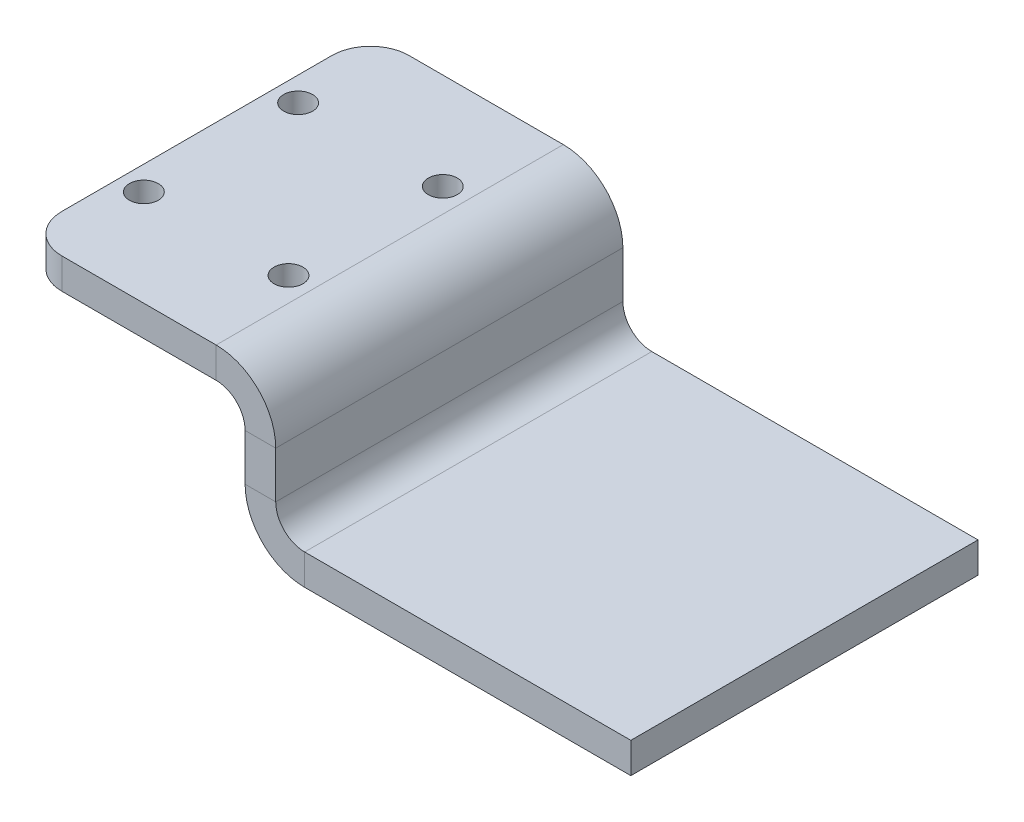
ISO-10303-21;
HEADER;
FILE_DESCRIPTION(('STEP AP214'),'2;1');
FILE_NAME('part.step','',(''),(''),'','','');
FILE_SCHEMA(('AUTOMOTIVE_DESIGN { 1 0 10303 214 1 1 1 1 }'));
ENDSEC;
DATA;
#1=APPLICATION_CONTEXT('core data for automotive mechanical design processes');
#2=APPLICATION_PROTOCOL_DEFINITION('international standard','automotive_design',2000,#1);
#3=PRODUCT_CONTEXT('',#1,'mechanical');
#4=PRODUCT('Part','Part','',(#3));
#5=PRODUCT_RELATED_PRODUCT_CATEGORY('part','',(#4));
#6=PRODUCT_DEFINITION_FORMATION('','',#4);
#7=PRODUCT_DEFINITION_CONTEXT('part definition',#1,'design');
#8=PRODUCT_DEFINITION('design','',#6,#7);
#9=PRODUCT_DEFINITION_SHAPE('','',#8);
#10=(LENGTH_UNIT() NAMED_UNIT(*) SI_UNIT(.MILLI.,.METRE.));
#11=(NAMED_UNIT(*) PLANE_ANGLE_UNIT() SI_UNIT($,.RADIAN.));
#12=(NAMED_UNIT(*) SI_UNIT($,.STERADIAN.) SOLID_ANGLE_UNIT());
#13=UNCERTAINTY_MEASURE_WITH_UNIT(LENGTH_MEASURE(1.E-05),#10,'distance_accuracy_value','');
#14=(GEOMETRIC_REPRESENTATION_CONTEXT(3) GLOBAL_UNCERTAINTY_ASSIGNED_CONTEXT((#13)) GLOBAL_UNIT_ASSIGNED_CONTEXT((#10,
#11,#12)) REPRESENTATION_CONTEXT('',''));
#15=CARTESIAN_POINT('',(0.,0.,0.));
#16=DIRECTION('',(0.,0.,1.));
#17=DIRECTION('',(1.,0.,0.));
#18=AXIS2_PLACEMENT_3D('',#15,#16,#17);
#19=CARTESIAN_POINT('',(26.175,-14.,18.));
#20=DIRECTION('',(0.,0.,-1.));
#21=DIRECTION('',(0.,1.,0.));
#22=AXIS2_PLACEMENT_3D('',#19,#20,#21);
#23=PLANE('',#22);
#24=DIRECTION('',(-1.,0.,0.));
#25=VECTOR('',#24,1.);
#26=CARTESIAN_POINT('',(26.175,-11.,18.));
#27=LINE('',#26,#25);
#28=CARTESIAN_POINT('',(26.175,-11.,18.));
#29=VERTEX_POINT('',#28);
#30=CARTESIAN_POINT('',(23.,-11.,18.));
#31=VERTEX_POINT('',#30);
#32=EDGE_CURVE('E203',#29,#31,#27,.T.);
#33=ORIENTED_EDGE('',*,*,#32,.F.);
#34=DIRECTION('',(0.,-1.,0.));
#35=VECTOR('',#34,1.);
#36=CARTESIAN_POINT('',(26.175,-14.,18.));
#37=LINE('',#36,#35);
#38=CARTESIAN_POINT('',(26.175,-6.17499999999998,18.));
#39=VERTEX_POINT('',#38);
#40=EDGE_CURVE('E219',#39,#29,#37,.T.);
#41=ORIENTED_EDGE('',*,*,#40,.F.);
#42=DIRECTION('',(1.,0.,0.));
#43=VECTOR('',#42,1.);
#44=CARTESIAN_POINT('',(23.,-6.17499999999999,18.));
#45=LINE('',#44,#43);
#46=CARTESIAN_POINT('',(23.,-6.17499999999999,18.));
#47=VERTEX_POINT('',#46);
#48=EDGE_CURVE('E210',#47,#39,#45,.T.);
#49=ORIENTED_EDGE('',*,*,#48,.F.);
#50=DIRECTION('',(0.,-1.,0.));
#51=VECTOR('',#50,1.);
#52=CARTESIAN_POINT('',(23.,-14.,18.));
#53=LINE('',#52,#51);
#54=EDGE_CURVE('E218',#47,#31,#53,.T.);
#55=ORIENTED_EDGE('',*,*,#54,.T.);
#56=EDGE_LOOP('',(#33,#41,#49,#55));
#57=FACE_BOUND('',#56,.T.);
#58=ADVANCED_FACE('F39',(#57),#23,.F.);
#59=CARTESIAN_POINT('',(26.175,-3.17499999999999,-18.));
#60=DIRECTION('',(0.,0.,1.));
#61=DIRECTION('',(0.,-1.,0.));
#62=AXIS2_PLACEMENT_3D('',#59,#60,#61);
#63=PLANE('',#62);
#64=DIRECTION('',(-1.,0.,0.));
#65=VECTOR('',#64,1.);
#66=CARTESIAN_POINT('',(26.175,-11.,-18.));
#67=LINE('',#66,#65);
#68=CARTESIAN_POINT('',(26.175,-11.,-18.));
#69=VERTEX_POINT('',#68);
#70=CARTESIAN_POINT('',(23.,-11.,-18.));
#71=VERTEX_POINT('',#70);
#72=EDGE_CURVE('E196',#69,#71,#67,.T.);
#73=ORIENTED_EDGE('',*,*,#72,.T.);
#74=DIRECTION('',(0.,1.,0.));
#75=VECTOR('',#74,1.);
#76=CARTESIAN_POINT('',(23.,-3.175,-18.));
#77=LINE('',#76,#75);
#78=CARTESIAN_POINT('',(23.,-6.17499999999999,-18.));
#79=VERTEX_POINT('',#78);
#80=EDGE_CURVE('E223',#71,#79,#77,.T.);
#81=ORIENTED_EDGE('',*,*,#80,.T.);
#82=DIRECTION('',(1.,0.,0.));
#83=VECTOR('',#82,1.);
#84=CARTESIAN_POINT('',(23.,-6.17499999999999,-18.));
#85=LINE('',#84,#83);
#86=CARTESIAN_POINT('',(26.175,-6.17499999999998,-18.));
#87=VERTEX_POINT('',#86);
#88=EDGE_CURVE('E206',#79,#87,#85,.T.);
#89=ORIENTED_EDGE('',*,*,#88,.T.);
#90=DIRECTION('',(0.,1.,0.));
#91=VECTOR('',#90,1.);
#92=CARTESIAN_POINT('',(26.175,-3.17499999999999,-18.));
#93=LINE('',#92,#91);
#94=EDGE_CURVE('E222',#69,#87,#93,.T.);
#95=ORIENTED_EDGE('',*,*,#94,.F.);
#96=EDGE_LOOP('',(#73,#81,#89,#95));
#97=FACE_BOUND('',#96,.T.);
#98=ADVANCED_FACE('F323',(#97),#63,.F.);
#99=CARTESIAN_POINT('',(26.175,0.,0.));
#100=DIRECTION('',(-1.,0.,0.));
#101=DIRECTION('',(0.,-1.,0.));
#102=AXIS2_PLACEMENT_3D('',#99,#100,#101);
#103=PLANE('',#102);
#104=DIRECTION('',(0.,0.,-1.));
#105=VECTOR('',#104,1.);
#106=CARTESIAN_POINT('',(26.175,-11.,-18.));
#107=LINE('',#106,#105);
#108=EDGE_CURVE('E200',#69,#29,#107,.F.);
#109=ORIENTED_EDGE('',*,*,#108,.F.);
#110=ORIENTED_EDGE('',*,*,#94,.T.);
#111=DIRECTION('',(0.,0.,-1.));
#112=VECTOR('',#111,1.);
#113=CARTESIAN_POINT('',(26.175,-6.17499999999998,0.));
#114=LINE('',#113,#112);
#115=EDGE_CURVE('E213',#39,#87,#114,.T.);
#116=ORIENTED_EDGE('',*,*,#115,.F.);
#117=ORIENTED_EDGE('',*,*,#40,.T.);
#118=EDGE_LOOP('',(#109,#110,#116,#117));
#119=FACE_BOUND('',#118,.T.);
#120=ADVANCED_FACE('F320',(#119),#103,.F.);
#121=CARTESIAN_POINT('',(23.,0.,0.));
#122=DIRECTION('',(-1.,0.,0.));
#123=DIRECTION('',(0.,-1.,0.));
#124=AXIS2_PLACEMENT_3D('',#121,#122,#123);
#125=PLANE('',#124);
#126=ORIENTED_EDGE('',*,*,#80,.F.);
#127=DIRECTION('',(0.,0.,-1.));
#128=VECTOR('',#127,1.);
#129=CARTESIAN_POINT('',(23.,-11.,-18.));
#130=LINE('',#129,#128);
#131=EDGE_CURVE('E149',#71,#31,#130,.F.);
#132=ORIENTED_EDGE('',*,*,#131,.T.);
#133=ORIENTED_EDGE('',*,*,#54,.F.);
#134=DIRECTION('',(0.,0.,1.));
#135=VECTOR('',#134,1.);
#136=CARTESIAN_POINT('',(23.,-6.17499999999999,-18.));
#137=LINE('',#136,#135);
#138=EDGE_CURVE('E208',#79,#47,#137,.T.);
#139=ORIENTED_EDGE('',*,*,#138,.F.);
#140=EDGE_LOOP('',(#126,#132,#133,#139));
#141=FACE_BOUND('',#140,.T.);
#142=ADVANCED_FACE('F314',(#141),#125,.T.);
#143=CARTESIAN_POINT('',(23.,-3.175,18.));
#144=DIRECTION('',(0.,0.,1.));
#145=DIRECTION('',(1.,0.,0.));
#146=AXIS2_PLACEMENT_3D('',#143,#144,#145);
#147=PLANE('',#146);
#148=DIRECTION('',(1.,0.,0.));
#149=VECTOR('',#148,1.);
#150=CARTESIAN_POINT('',(23.,0.,18.));
#151=LINE('',#150,#149);
#152=CARTESIAN_POINT('',(4.,0.,18.));
#153=VERTEX_POINT('',#152);
#154=CARTESIAN_POINT('',(20.,0.,18.));
#155=VERTEX_POINT('',#154);
#156=EDGE_CURVE('E255',#153,#155,#151,.T.);
#157=ORIENTED_EDGE('',*,*,#156,.F.);
#158=DIRECTION('',(0.,1.,0.));
#159=VECTOR('',#158,1.);
#160=CARTESIAN_POINT('',(4.,-3.175,18.));
#161=LINE('',#160,#159);
#162=CARTESIAN_POINT('',(4.,-3.175,18.));
#163=VERTEX_POINT('',#162);
#164=EDGE_CURVE('E62',#153,#163,#161,.F.);
#165=ORIENTED_EDGE('',*,*,#164,.T.);
#166=DIRECTION('',(1.,0.,0.));
#167=VECTOR('',#166,1.);
#168=CARTESIAN_POINT('',(23.,-3.175,18.));
#169=LINE('',#168,#167);
#170=CARTESIAN_POINT('',(20.,-3.175,18.));
#171=VERTEX_POINT('',#170);
#172=EDGE_CURVE('E258',#163,#171,#169,.T.);
#173=ORIENTED_EDGE('',*,*,#172,.T.);
#174=DIRECTION('',(0.,1.,0.));
#175=VECTOR('',#174,1.);
#176=CARTESIAN_POINT('',(20.,-3.175,18.));
#177=LINE('',#176,#175);
#178=EDGE_CURVE('E236',#171,#155,#177,.T.);
#179=ORIENTED_EDGE('',*,*,#178,.T.);
#180=EDGE_LOOP('',(#157,#165,#173,#179));
#181=FACE_BOUND('',#180,.T.);
#182=ADVANCED_FACE('F289',(#181),#147,.T.);
#183=CARTESIAN_POINT('',(0.,-3.175,0.));
#184=DIRECTION('',(0.,1.,0.));
#185=DIRECTION('',(0.,0.,1.));
#186=AXIS2_PLACEMENT_3D('',#183,#184,#185);
#187=PLANE('',#186);
#188=CARTESIAN_POINT('',(17.5,-3.175,-8.));
#189=DIRECTION('',(0.,1.,0.));
#190=DIRECTION('',(0.,0.,1.));
#191=AXIS2_PLACEMENT_3D('',#188,#189,#190);
#192=CIRCLE('',#191,1.5);
#193=CARTESIAN_POINT('',(17.5,-3.175,-6.5));
#194=VERTEX_POINT('',#193);
#195=EDGE_CURVE('E340',#194,#194,#192,.T.);
#196=ORIENTED_EDGE('',*,*,#195,.T.);
#197=EDGE_LOOP('',(#196));
#198=FACE_BOUND('',#197,.T.);
#199=CARTESIAN_POINT('',(2.5,-3.175,-8.));
#200=DIRECTION('',(0.,1.,0.));
#201=DIRECTION('',(0.,0.,1.));
#202=AXIS2_PLACEMENT_3D('',#199,#200,#201);
#203=CIRCLE('',#202,1.5);
#204=CARTESIAN_POINT('',(2.5,-3.175,-6.5));
#205=VERTEX_POINT('',#204);
#206=EDGE_CURVE('E343',#205,#205,#203,.T.);
#207=ORIENTED_EDGE('',*,*,#206,.T.);
#208=EDGE_LOOP('',(#207));
#209=FACE_BOUND('',#208,.T.);
#210=CARTESIAN_POINT('',(2.5,-3.175,8.));
#211=DIRECTION('',(0.,1.,0.));
#212=DIRECTION('',(0.,0.,1.));
#213=AXIS2_PLACEMENT_3D('',#210,#211,#212);
#214=CIRCLE('',#213,1.5);
#215=CARTESIAN_POINT('',(2.5,-3.175,9.5));
#216=VERTEX_POINT('',#215);
#217=EDGE_CURVE('E346',#216,#216,#214,.T.);
#218=ORIENTED_EDGE('',*,*,#217,.T.);
#219=EDGE_LOOP('',(#218));
#220=FACE_BOUND('',#219,.T.);
#221=CARTESIAN_POINT('',(17.5,-3.175,8.));
#222=DIRECTION('',(0.,1.,0.));
#223=DIRECTION('',(0.,0.,1.));
#224=AXIS2_PLACEMENT_3D('',#221,#222,#223);
#225=CIRCLE('',#224,1.5);
#226=CARTESIAN_POINT('',(17.5,-3.175,9.5));
#227=VERTEX_POINT('',#226);
#228=EDGE_CURVE('E333',#227,#227,#225,.T.);
#229=ORIENTED_EDGE('',*,*,#228,.T.);
#230=EDGE_LOOP('',(#229));
#231=FACE_BOUND('',#230,.T.);
#232=ORIENTED_EDGE('',*,*,#172,.F.);
#233=CARTESIAN_POINT('',(4.,-3.175,14.));
#234=DIRECTION('',(0.,1.,0.));
#235=DIRECTION('',(0.,0.,1.));
#236=AXIS2_PLACEMENT_3D('',#233,#234,#235);
#237=CIRCLE('',#236,4.);
#238=CARTESIAN_POINT('',(0.,-3.175,14.));
#239=VERTEX_POINT('',#238);
#240=EDGE_CURVE('E47',#163,#239,#237,.F.);
#241=ORIENTED_EDGE('',*,*,#240,.T.);
#242=DIRECTION('',(0.,0.,1.));
#243=VECTOR('',#242,1.);
#244=CARTESIAN_POINT('',(0.,-3.175,18.));
#245=LINE('',#244,#243);
#246=CARTESIAN_POINT('',(0.,-3.175,-14.));
#247=VERTEX_POINT('',#246);
#248=EDGE_CURVE('E254',#247,#239,#245,.T.);
#249=ORIENTED_EDGE('',*,*,#248,.F.);
#250=CARTESIAN_POINT('',(3.99999999999999,-3.175,-14.));
#251=DIRECTION('',(0.,1.,0.));
#252=DIRECTION('',(0.,0.,1.));
#253=AXIS2_PLACEMENT_3D('',#250,#251,#252);
#254=CIRCLE('',#253,4.);
#255=CARTESIAN_POINT('',(3.99999999999999,-3.175,-18.));
#256=VERTEX_POINT('',#255);
#257=EDGE_CURVE('E54',#247,#256,#254,.F.);
#258=ORIENTED_EDGE('',*,*,#257,.T.);
#259=DIRECTION('',(-1.,0.,0.));
#260=VECTOR('',#259,1.);
#261=CARTESIAN_POINT('',(23.,-3.175,-18.));
#262=LINE('',#261,#260);
#263=CARTESIAN_POINT('',(20.,-3.175,-18.));
#264=VERTEX_POINT('',#263);
#265=EDGE_CURVE('E252',#264,#256,#262,.T.);
#266=ORIENTED_EDGE('',*,*,#265,.F.);
#267=DIRECTION('',(0.,0.,1.));
#268=VECTOR('',#267,1.);
#269=CARTESIAN_POINT('',(20.,-3.175,18.));
#270=LINE('',#269,#268);
#271=EDGE_CURVE('E242',#171,#264,#270,.F.);
#272=ORIENTED_EDGE('',*,*,#271,.F.);
#273=EDGE_LOOP('',(#232,#241,#249,#258,#266,#272));
#274=FACE_BOUND('',#273,.T.);
#275=ADVANCED_FACE('F277',(#198,#209,#220,#231,#274),#187,.F.);
#276=CARTESIAN_POINT('',(0.,0.,0.));
#277=DIRECTION('',(0.,1.,0.));
#278=DIRECTION('',(0.,0.,1.));
#279=AXIS2_PLACEMENT_3D('',#276,#277,#278);
#280=PLANE('',#279);
#281=CARTESIAN_POINT('',(17.5,0.,-8.));
#282=DIRECTION('',(0.,1.,0.));
#283=DIRECTION('',(0.,0.,1.));
#284=AXIS2_PLACEMENT_3D('',#281,#282,#283);
#285=CIRCLE('',#284,1.5);
#286=CARTESIAN_POINT('',(17.5,0.,-6.5));
#287=VERTEX_POINT('',#286);
#288=EDGE_CURVE('E349',#287,#287,#285,.T.);
#289=ORIENTED_EDGE('',*,*,#288,.F.);
#290=EDGE_LOOP('',(#289));
#291=FACE_BOUND('',#290,.T.);
#292=CARTESIAN_POINT('',(2.5,0.,-8.));
#293=DIRECTION('',(0.,1.,0.));
#294=DIRECTION('',(0.,0.,1.));
#295=AXIS2_PLACEMENT_3D('',#292,#293,#294);
#296=CIRCLE('',#295,1.5);
#297=CARTESIAN_POINT('',(2.5,0.,-6.5));
#298=VERTEX_POINT('',#297);
#299=EDGE_CURVE('E353',#298,#298,#296,.T.);
#300=ORIENTED_EDGE('',*,*,#299,.F.);
#301=EDGE_LOOP('',(#300));
#302=FACE_BOUND('',#301,.T.);
#303=CARTESIAN_POINT('',(2.5,0.,8.));
#304=DIRECTION('',(0.,1.,0.));
#305=DIRECTION('',(0.,0.,1.));
#306=AXIS2_PLACEMENT_3D('',#303,#304,#305);
#307=CIRCLE('',#306,1.5);
#308=CARTESIAN_POINT('',(2.5,0.,9.5));
#309=VERTEX_POINT('',#308);
#310=EDGE_CURVE('E350',#309,#309,#307,.T.);
#311=ORIENTED_EDGE('',*,*,#310,.F.);
#312=EDGE_LOOP('',(#311));
#313=FACE_BOUND('',#312,.T.);
#314=CARTESIAN_POINT('',(17.5,0.,8.));
#315=DIRECTION('',(0.,1.,0.));
#316=DIRECTION('',(0.,0.,1.));
#317=AXIS2_PLACEMENT_3D('',#314,#315,#316);
#318=CIRCLE('',#317,1.5);
#319=CARTESIAN_POINT('',(17.5,0.,9.5));
#320=VERTEX_POINT('',#319);
#321=EDGE_CURVE('E337',#320,#320,#318,.T.);
#322=ORIENTED_EDGE('',*,*,#321,.F.);
#323=EDGE_LOOP('',(#322));
#324=FACE_BOUND('',#323,.T.);
#325=DIRECTION('',(0.,0.,1.));
#326=VECTOR('',#325,1.);
#327=CARTESIAN_POINT('',(0.,0.,18.));
#328=LINE('',#327,#326);
#329=CARTESIAN_POINT('',(0.,0.,-14.));
#330=VERTEX_POINT('',#329);
#331=CARTESIAN_POINT('',(0.,0.,14.));
#332=VERTEX_POINT('',#331);
#333=EDGE_CURVE('E263',#330,#332,#328,.T.);
#334=ORIENTED_EDGE('',*,*,#333,.T.);
#335=CARTESIAN_POINT('',(4.,0.,14.));
#336=DIRECTION('',(0.,1.,0.));
#337=DIRECTION('',(0.,0.,1.));
#338=AXIS2_PLACEMENT_3D('',#335,#336,#337);
#339=CIRCLE('',#338,4.);
#340=EDGE_CURVE('E273',#332,#153,#339,.T.);
#341=ORIENTED_EDGE('',*,*,#340,.T.);
#342=ORIENTED_EDGE('',*,*,#156,.T.);
#343=DIRECTION('',(0.,0.,1.));
#344=VECTOR('',#343,1.);
#345=CARTESIAN_POINT('',(20.,0.,18.));
#346=LINE('',#345,#344);
#347=CARTESIAN_POINT('',(20.,0.,-18.));
#348=VERTEX_POINT('',#347);
#349=EDGE_CURVE('E229',#155,#348,#346,.F.);
#350=ORIENTED_EDGE('',*,*,#349,.T.);
#351=DIRECTION('',(-1.,0.,0.));
#352=VECTOR('',#351,1.);
#353=CARTESIAN_POINT('',(23.,0.,-18.));
#354=LINE('',#353,#352);
#355=CARTESIAN_POINT('',(3.99999999999999,0.,-18.));
#356=VERTEX_POINT('',#355);
#357=EDGE_CURVE('E249',#348,#356,#354,.T.);
#358=ORIENTED_EDGE('',*,*,#357,.T.);
#359=CARTESIAN_POINT('',(3.99999999999999,0.,-14.));
#360=DIRECTION('',(0.,1.,0.));
#361=DIRECTION('',(0.,0.,1.));
#362=AXIS2_PLACEMENT_3D('',#359,#360,#361);
#363=CIRCLE('',#362,4.);
#364=EDGE_CURVE('E271',#356,#330,#363,.T.);
#365=ORIENTED_EDGE('',*,*,#364,.T.);
#366=EDGE_LOOP('',(#334,#341,#342,#350,#358,#365));
#367=FACE_BOUND('',#366,.T.);
#368=ADVANCED_FACE('F287',(#291,#302,#313,#324,#367),#280,.T.);
#369=CARTESIAN_POINT('',(0.,-3.175,18.));
#370=DIRECTION('',(-1.,0.,0.));
#371=DIRECTION('',(0.,0.,1.));
#372=AXIS2_PLACEMENT_3D('',#369,#370,#371);
#373=PLANE('',#372);
#374=ORIENTED_EDGE('',*,*,#248,.T.);
#375=DIRECTION('',(0.,1.,0.));
#376=VECTOR('',#375,1.);
#377=CARTESIAN_POINT('',(0.,-3.175,14.));
#378=LINE('',#377,#376);
#379=EDGE_CURVE('E268',#239,#332,#378,.T.);
#380=ORIENTED_EDGE('',*,*,#379,.T.);
#381=ORIENTED_EDGE('',*,*,#333,.F.);
#382=DIRECTION('',(0.,1.,0.));
#383=VECTOR('',#382,1.);
#384=CARTESIAN_POINT('',(0.,-3.175,-14.));
#385=LINE('',#384,#383);
#386=EDGE_CURVE('E260',#330,#247,#385,.F.);
#387=ORIENTED_EDGE('',*,*,#386,.T.);
#388=EDGE_LOOP('',(#374,#380,#381,#387));
#389=FACE_BOUND('',#388,.T.);
#390=ADVANCED_FACE('F282',(#389),#373,.T.);
#391=CARTESIAN_POINT('',(23.,-3.175,-18.));
#392=DIRECTION('',(0.,0.,-1.));
#393=DIRECTION('',(-1.,0.,0.));
#394=AXIS2_PLACEMENT_3D('',#391,#392,#393);
#395=PLANE('',#394);
#396=ORIENTED_EDGE('',*,*,#265,.T.);
#397=DIRECTION('',(0.,1.,0.));
#398=VECTOR('',#397,1.);
#399=CARTESIAN_POINT('',(3.99999999999999,-3.175,-18.));
#400=LINE('',#399,#398);
#401=EDGE_CURVE('E11',#256,#356,#400,.T.);
#402=ORIENTED_EDGE('',*,*,#401,.T.);
#403=ORIENTED_EDGE('',*,*,#357,.F.);
#404=DIRECTION('',(0.,1.,0.));
#405=VECTOR('',#404,1.);
#406=CARTESIAN_POINT('',(20.,-3.175,-18.));
#407=LINE('',#406,#405);
#408=EDGE_CURVE('E246',#264,#348,#407,.T.);
#409=ORIENTED_EDGE('',*,*,#408,.F.);
#410=EDGE_LOOP('',(#396,#402,#403,#409));
#411=FACE_BOUND('',#410,.T.);
#412=ADVANCED_FACE('F302',(#411),#395,.T.);
#413=CARTESIAN_POINT('',(20.,-6.175,-18.));
#414=DIRECTION('',(0.,0.,-1.));
#415=DIRECTION('',(-1.,0.,0.));
#416=AXIS2_PLACEMENT_3D('',#413,#414,#415);
#417=PLANE('',#416);
#418=ORIENTED_EDGE('',*,*,#88,.F.);
#419=CARTESIAN_POINT('',(20.,-6.175,-18.));
#420=DIRECTION('',(0.,0.,1.));
#421=DIRECTION('',(1.,0.,0.));
#422=AXIS2_PLACEMENT_3D('',#419,#420,#421);
#423=CIRCLE('',#422,3.);
#424=EDGE_CURVE('E239',#264,#79,#423,.F.);
#425=ORIENTED_EDGE('',*,*,#424,.F.);
#426=ORIENTED_EDGE('',*,*,#408,.T.);
#427=CARTESIAN_POINT('',(20.,-6.175,-18.));
#428=DIRECTION('',(0.,0.,1.));
#429=DIRECTION('',(1.,0.,0.));
#430=AXIS2_PLACEMENT_3D('',#427,#428,#429);
#431=CIRCLE('',#430,6.175);
#432=EDGE_CURVE('E232',#348,#87,#431,.F.);
#433=ORIENTED_EDGE('',*,*,#432,.T.);
#434=EDGE_LOOP('',(#418,#425,#426,#433));
#435=FACE_BOUND('',#434,.T.);
#436=ADVANCED_FACE('F310',(#435),#417,.T.);
#437=CARTESIAN_POINT('',(20.,-6.175,18.));
#438=DIRECTION('',(0.,0.,-1.));
#439=DIRECTION('',(-1.,0.,0.));
#440=AXIS2_PLACEMENT_3D('',#437,#438,#439);
#441=PLANE('',#440);
#442=CARTESIAN_POINT('',(20.,-6.175,18.));
#443=DIRECTION('',(0.,0.,1.));
#444=DIRECTION('',(1.,0.,0.));
#445=AXIS2_PLACEMENT_3D('',#442,#443,#444);
#446=CIRCLE('',#445,3.);
#447=EDGE_CURVE('E225',#47,#171,#446,.T.);
#448=ORIENTED_EDGE('',*,*,#447,.F.);
#449=ORIENTED_EDGE('',*,*,#48,.T.);
#450=CARTESIAN_POINT('',(20.,-6.175,18.));
#451=DIRECTION('',(0.,0.,1.));
#452=DIRECTION('',(1.,0.,0.));
#453=AXIS2_PLACEMENT_3D('',#450,#451,#452);
#454=CIRCLE('',#453,6.175);
#455=EDGE_CURVE('E233',#39,#155,#454,.T.);
#456=ORIENTED_EDGE('',*,*,#455,.T.);
#457=ORIENTED_EDGE('',*,*,#178,.F.);
#458=EDGE_LOOP('',(#448,#449,#456,#457));
#459=FACE_BOUND('',#458,.T.);
#460=ADVANCED_FACE('F293',(#459),#441,.F.);
#461=CARTESIAN_POINT('',(20.,-6.175,18.));
#462=DIRECTION('',(0.,0.,1.));
#463=DIRECTION('',(1.,0.,0.));
#464=AXIS2_PLACEMENT_3D('',#461,#462,#463);
#465=CYLINDRICAL_SURFACE('',#464,6.175);
#466=ORIENTED_EDGE('',*,*,#349,.F.);
#467=ORIENTED_EDGE('',*,*,#455,.F.);
#468=ORIENTED_EDGE('',*,*,#115,.T.);
#469=ORIENTED_EDGE('',*,*,#432,.F.);
#470=EDGE_LOOP('',(#466,#467,#468,#469));
#471=FACE_BOUND('',#470,.T.);
#472=ADVANCED_FACE('F306',(#471),#465,.T.);
#473=CARTESIAN_POINT('',(20.,-6.175,18.));
#474=DIRECTION('',(0.,0.,1.));
#475=DIRECTION('',(1.,0.,0.));
#476=AXIS2_PLACEMENT_3D('',#473,#474,#475);
#477=CYLINDRICAL_SURFACE('',#476,3.);
#478=ORIENTED_EDGE('',*,*,#271,.T.);
#479=ORIENTED_EDGE('',*,*,#424,.T.);
#480=ORIENTED_EDGE('',*,*,#138,.T.);
#481=ORIENTED_EDGE('',*,*,#447,.T.);
#482=EDGE_LOOP('',(#478,#479,#480,#481));
#483=FACE_BOUND('',#482,.T.);
#484=ADVANCED_FACE('F296',(#483),#477,.F.);
#485=CARTESIAN_POINT('',(29.175,-11.,18.));
#486=DIRECTION('',(0.,0.,1.));
#487=DIRECTION('',(1.,0.,0.));
#488=AXIS2_PLACEMENT_3D('',#485,#486,#487);
#489=PLANE('',#488);
#490=DIRECTION('',(0.,-1.,0.));
#491=VECTOR('',#490,1.);
#492=CARTESIAN_POINT('',(29.175,-14.,18.));
#493=LINE('',#492,#491);
#494=CARTESIAN_POINT('',(29.175,-14.,18.));
#495=VERTEX_POINT('',#494);
#496=CARTESIAN_POINT('',(29.175,-17.175,18.));
#497=VERTEX_POINT('',#496);
#498=EDGE_CURVE('E330',#495,#497,#493,.T.);
#499=ORIENTED_EDGE('',*,*,#498,.F.);
#500=CARTESIAN_POINT('',(29.175,-11.,18.));
#501=DIRECTION('',(0.,0.,-1.));
#502=DIRECTION('',(-1.,0.,0.));
#503=AXIS2_PLACEMENT_3D('',#500,#501,#502);
#504=CIRCLE('',#503,3.);
#505=EDGE_CURVE('E152',#29,#495,#504,.F.);
#506=ORIENTED_EDGE('',*,*,#505,.F.);
#507=ORIENTED_EDGE('',*,*,#32,.T.);
#508=CARTESIAN_POINT('',(29.175,-11.,18.));
#509=DIRECTION('',(0.,0.,-1.));
#510=DIRECTION('',(-1.,0.,0.));
#511=AXIS2_PLACEMENT_3D('',#508,#509,#510);
#512=CIRCLE('',#511,6.175);
#513=EDGE_CURVE('E195',#31,#497,#512,.F.);
#514=ORIENTED_EDGE('',*,*,#513,.T.);
#515=EDGE_LOOP('',(#499,#506,#507,#514));
#516=FACE_BOUND('',#515,.T.);
#517=ADVANCED_FACE('F400',(#516),#489,.T.);
#518=CARTESIAN_POINT('',(29.175,-11.,-18.));
#519=DIRECTION('',(0.,0.,1.));
#520=DIRECTION('',(1.,0.,0.));
#521=AXIS2_PLACEMENT_3D('',#518,#519,#520);
#522=PLANE('',#521);
#523=CARTESIAN_POINT('',(29.175,-11.,-18.));
#524=DIRECTION('',(0.,0.,-1.));
#525=DIRECTION('',(-1.,0.,0.));
#526=AXIS2_PLACEMENT_3D('',#523,#524,#525);
#527=CIRCLE('',#526,3.);
#528=CARTESIAN_POINT('',(29.175,-14.,-18.));
#529=VERTEX_POINT('',#528);
#530=EDGE_CURVE('E159',#529,#69,#527,.T.);
#531=ORIENTED_EDGE('',*,*,#530,.F.);
#532=DIRECTION('',(0.,-1.,0.));
#533=VECTOR('',#532,1.);
#534=CARTESIAN_POINT('',(29.175,-14.,-18.));
#535=LINE('',#534,#533);
#536=CARTESIAN_POINT('',(29.175,-17.175,-18.));
#537=VERTEX_POINT('',#536);
#538=EDGE_CURVE('E156',#529,#537,#535,.T.);
#539=ORIENTED_EDGE('',*,*,#538,.T.);
#540=CARTESIAN_POINT('',(29.175,-11.,-18.));
#541=DIRECTION('',(0.,0.,-1.));
#542=DIRECTION('',(-1.,0.,0.));
#543=AXIS2_PLACEMENT_3D('',#540,#541,#542);
#544=CIRCLE('',#543,6.175);
#545=EDGE_CURVE('E142',#537,#71,#544,.T.);
#546=ORIENTED_EDGE('',*,*,#545,.T.);
#547=ORIENTED_EDGE('',*,*,#72,.F.);
#548=EDGE_LOOP('',(#531,#539,#546,#547));
#549=FACE_BOUND('',#548,.T.);
#550=ADVANCED_FACE('F157',(#549),#522,.F.);
#551=CARTESIAN_POINT('',(29.175,-11.,-18.));
#552=DIRECTION('',(0.,0.,-1.));
#553=DIRECTION('',(0.,-1.,0.));
#554=AXIS2_PLACEMENT_3D('',#551,#552,#553);
#555=CYLINDRICAL_SURFACE('',#554,6.175);
#556=ORIENTED_EDGE('',*,*,#131,.F.);
#557=ORIENTED_EDGE('',*,*,#545,.F.);
#558=DIRECTION('',(0.,0.,1.));
#559=VECTOR('',#558,1.);
#560=CARTESIAN_POINT('',(29.175,-17.175,0.));
#561=LINE('',#560,#559);
#562=EDGE_CURVE('E146',#537,#497,#561,.T.);
#563=ORIENTED_EDGE('',*,*,#562,.T.);
#564=ORIENTED_EDGE('',*,*,#513,.F.);
#565=EDGE_LOOP('',(#556,#557,#563,#564));
#566=FACE_BOUND('',#565,.T.);
#567=ADVANCED_FACE('F144',(#566),#555,.T.);
#568=CARTESIAN_POINT('',(29.175,-11.,-18.));
#569=DIRECTION('',(0.,0.,-1.));
#570=DIRECTION('',(0.,-1.,0.));
#571=AXIS2_PLACEMENT_3D('',#568,#569,#570);
#572=CYLINDRICAL_SURFACE('',#571,3.);
#573=ORIENTED_EDGE('',*,*,#108,.T.);
#574=ORIENTED_EDGE('',*,*,#505,.T.);
#575=DIRECTION('',(0.,0.,-1.));
#576=VECTOR('',#575,1.);
#577=CARTESIAN_POINT('',(29.175,-14.,18.));
#578=LINE('',#577,#576);
#579=EDGE_CURVE('E163',#495,#529,#578,.T.);
#580=ORIENTED_EDGE('',*,*,#579,.T.);
#581=ORIENTED_EDGE('',*,*,#530,.T.);
#582=EDGE_LOOP('',(#573,#574,#580,#581));
#583=FACE_BOUND('',#582,.T.);
#584=ADVANCED_FACE('F325',(#583),#572,.F.);
#585=CARTESIAN_POINT('',(63.,-17.175,-18.));
#586=DIRECTION('',(0.,0.,1.));
#587=DIRECTION('',(1.,0.,0.));
#588=AXIS2_PLACEMENT_3D('',#585,#586,#587);
#589=PLANE('',#588);
#590=ORIENTED_EDGE('',*,*,#538,.F.);
#591=DIRECTION('',(1.,0.,0.));
#592=VECTOR('',#591,1.);
#593=CARTESIAN_POINT('',(63.,-14.,-18.));
#594=LINE('',#593,#592);
#595=CARTESIAN_POINT('',(63.,-14.,-18.));
#596=VERTEX_POINT('',#595);
#597=EDGE_CURVE('E172',#529,#596,#594,.T.);
#598=ORIENTED_EDGE('',*,*,#597,.T.);
#599=DIRECTION('',(0.,1.,0.));
#600=VECTOR('',#599,1.);
#601=CARTESIAN_POINT('',(63.,-17.175,-18.));
#602=LINE('',#601,#600);
#603=CARTESIAN_POINT('',(63.,-17.175,-18.));
#604=VERTEX_POINT('',#603);
#605=EDGE_CURVE('E176',#604,#596,#602,.T.);
#606=ORIENTED_EDGE('',*,*,#605,.F.);
#607=DIRECTION('',(1.,0.,0.));
#608=VECTOR('',#607,1.);
#609=CARTESIAN_POINT('',(63.,-17.175,-18.));
#610=LINE('',#609,#608);
#611=EDGE_CURVE('E168',#537,#604,#610,.T.);
#612=ORIENTED_EDGE('',*,*,#611,.F.);
#613=EDGE_LOOP('',(#590,#598,#606,#612));
#614=FACE_BOUND('',#613,.T.);
#615=ADVANCED_FACE('F174',(#614),#589,.F.);
#616=CARTESIAN_POINT('',(26.175,-17.175,18.));
#617=DIRECTION('',(0.,0.,-1.));
#618=DIRECTION('',(-1.,0.,0.));
#619=AXIS2_PLACEMENT_3D('',#616,#617,#618);
#620=PLANE('',#619);
#621=ORIENTED_EDGE('',*,*,#498,.T.);
#622=DIRECTION('',(-1.,0.,0.));
#623=VECTOR('',#622,1.);
#624=CARTESIAN_POINT('',(26.175,-17.175,18.));
#625=LINE('',#624,#623);
#626=CARTESIAN_POINT('',(63.,-17.175,18.));
#627=VERTEX_POINT('',#626);
#628=EDGE_CURVE('E171',#627,#497,#625,.T.);
#629=ORIENTED_EDGE('',*,*,#628,.F.);
#630=DIRECTION('',(0.,1.,0.));
#631=VECTOR('',#630,1.);
#632=CARTESIAN_POINT('',(63.,-17.175,18.));
#633=LINE('',#632,#631);
#634=CARTESIAN_POINT('',(63.,-14.,18.));
#635=VERTEX_POINT('',#634);
#636=EDGE_CURVE('E188',#627,#635,#633,.T.);
#637=ORIENTED_EDGE('',*,*,#636,.T.);
#638=DIRECTION('',(-1.,0.,0.));
#639=VECTOR('',#638,1.);
#640=CARTESIAN_POINT('',(26.175,-14.,18.));
#641=LINE('',#640,#639);
#642=EDGE_CURVE('E179',#635,#495,#641,.T.);
#643=ORIENTED_EDGE('',*,*,#642,.T.);
#644=EDGE_LOOP('',(#621,#629,#637,#643));
#645=FACE_BOUND('',#644,.T.);
#646=ADVANCED_FACE('F448',(#645),#620,.F.);
#647=CARTESIAN_POINT('',(0.,-17.175,0.));
#648=DIRECTION('',(0.,1.,0.));
#649=DIRECTION('',(-1.,0.,0.));
#650=AXIS2_PLACEMENT_3D('',#647,#648,#649);
#651=PLANE('',#650);
#652=ORIENTED_EDGE('',*,*,#562,.F.);
#653=ORIENTED_EDGE('',*,*,#611,.T.);
#654=DIRECTION('',(0.,0.,1.));
#655=VECTOR('',#654,1.);
#656=CARTESIAN_POINT('',(63.,-17.175,18.));
#657=LINE('',#656,#655);
#658=EDGE_CURVE('E178',#604,#627,#657,.T.);
#659=ORIENTED_EDGE('',*,*,#658,.T.);
#660=ORIENTED_EDGE('',*,*,#628,.T.);
#661=EDGE_LOOP('',(#652,#653,#659,#660));
#662=FACE_BOUND('',#661,.T.);
#663=ADVANCED_FACE('F167',(#662),#651,.F.);
#664=CARTESIAN_POINT('',(0.,-14.,0.));
#665=DIRECTION('',(0.,1.,0.));
#666=DIRECTION('',(-1.,0.,0.));
#667=AXIS2_PLACEMENT_3D('',#664,#665,#666);
#668=PLANE('',#667);
#669=ORIENTED_EDGE('',*,*,#597,.F.);
#670=ORIENTED_EDGE('',*,*,#579,.F.);
#671=ORIENTED_EDGE('',*,*,#642,.F.);
#672=DIRECTION('',(0.,0.,1.));
#673=VECTOR('',#672,1.);
#674=CARTESIAN_POINT('',(63.,-14.,18.));
#675=LINE('',#674,#673);
#676=EDGE_CURVE('E183',#596,#635,#675,.T.);
#677=ORIENTED_EDGE('',*,*,#676,.F.);
#678=EDGE_LOOP('',(#669,#670,#671,#677));
#679=FACE_BOUND('',#678,.T.);
#680=ADVANCED_FACE('F462',(#679),#668,.T.);
#681=CARTESIAN_POINT('',(63.,-17.175,18.));
#682=DIRECTION('',(-1.,0.,0.));
#683=DIRECTION('',(0.,-1.,0.));
#684=AXIS2_PLACEMENT_3D('',#681,#682,#683);
#685=PLANE('',#684);
#686=ORIENTED_EDGE('',*,*,#676,.T.);
#687=ORIENTED_EDGE('',*,*,#636,.F.);
#688=ORIENTED_EDGE('',*,*,#658,.F.);
#689=ORIENTED_EDGE('',*,*,#605,.T.);
#690=EDGE_LOOP('',(#686,#687,#688,#689));
#691=FACE_BOUND('',#690,.T.);
#692=ADVANCED_FACE('F375',(#691),#685,.F.);
#693=CARTESIAN_POINT('',(17.5,-17.175,8.));
#694=DIRECTION('',(0.,1.,0.));
#695=DIRECTION('',(0.,0.,1.));
#696=AXIS2_PLACEMENT_3D('',#693,#694,#695);
#697=CYLINDRICAL_SURFACE('',#696,1.5);
#698=ORIENTED_EDGE('',*,*,#321,.T.);
#699=EDGE_LOOP('',(#698));
#700=FACE_BOUND('',#699,.T.);
#701=ORIENTED_EDGE('',*,*,#228,.F.);
#702=EDGE_LOOP('',(#701));
#703=FACE_BOUND('',#702,.T.);
#704=ADVANCED_FACE('F371',(#700,#703),#697,.F.);
#705=CARTESIAN_POINT('',(2.5,-17.175,8.));
#706=DIRECTION('',(0.,1.,0.));
#707=DIRECTION('',(0.,0.,1.));
#708=AXIS2_PLACEMENT_3D('',#705,#706,#707);
#709=CYLINDRICAL_SURFACE('',#708,1.5);
#710=ORIENTED_EDGE('',*,*,#310,.T.);
#711=EDGE_LOOP('',(#710));
#712=FACE_BOUND('',#711,.T.);
#713=ORIENTED_EDGE('',*,*,#217,.F.);
#714=EDGE_LOOP('',(#713));
#715=FACE_BOUND('',#714,.T.);
#716=ADVANCED_FACE('F374',(#712,#715),#709,.F.);
#717=CARTESIAN_POINT('',(2.5,-17.175,-8.));
#718=DIRECTION('',(0.,1.,0.));
#719=DIRECTION('',(0.,0.,1.));
#720=AXIS2_PLACEMENT_3D('',#717,#718,#719);
#721=CYLINDRICAL_SURFACE('',#720,1.5);
#722=ORIENTED_EDGE('',*,*,#299,.T.);
#723=EDGE_LOOP('',(#722));
#724=FACE_BOUND('',#723,.T.);
#725=ORIENTED_EDGE('',*,*,#206,.F.);
#726=EDGE_LOOP('',(#725));
#727=FACE_BOUND('',#726,.T.);
#728=ADVANCED_FACE('F486',(#724,#727),#721,.F.);
#729=CARTESIAN_POINT('',(17.5,-17.175,-8.));
#730=DIRECTION('',(0.,1.,0.));
#731=DIRECTION('',(0.,0.,1.));
#732=AXIS2_PLACEMENT_3D('',#729,#730,#731);
#733=CYLINDRICAL_SURFACE('',#732,1.5);
#734=ORIENTED_EDGE('',*,*,#288,.T.);
#735=EDGE_LOOP('',(#734));
#736=FACE_BOUND('',#735,.T.);
#737=ORIENTED_EDGE('',*,*,#195,.F.);
#738=EDGE_LOOP('',(#737));
#739=FACE_BOUND('',#738,.T.);
#740=ADVANCED_FACE('F359',(#736,#739),#733,.F.);
#741=CARTESIAN_POINT('',(4.,-3.175,14.));
#742=DIRECTION('',(0.,1.,0.));
#743=DIRECTION('',(0.,0.,1.));
#744=AXIS2_PLACEMENT_3D('',#741,#742,#743);
#745=CYLINDRICAL_SURFACE('',#744,4.);
#746=ORIENTED_EDGE('',*,*,#240,.F.);
#747=ORIENTED_EDGE('',*,*,#164,.F.);
#748=ORIENTED_EDGE('',*,*,#340,.F.);
#749=ORIENTED_EDGE('',*,*,#379,.F.);
#750=EDGE_LOOP('',(#746,#747,#748,#749));
#751=FACE_BOUND('',#750,.T.);
#752=ADVANCED_FACE('F285',(#751),#745,.T.);
#753=CARTESIAN_POINT('',(3.99999999999999,-3.175,-14.));
#754=DIRECTION('',(0.,1.,0.));
#755=DIRECTION('',(0.,0.,1.));
#756=AXIS2_PLACEMENT_3D('',#753,#754,#755);
#757=CYLINDRICAL_SURFACE('',#756,4.);
#758=ORIENTED_EDGE('',*,*,#257,.F.);
#759=ORIENTED_EDGE('',*,*,#386,.F.);
#760=ORIENTED_EDGE('',*,*,#364,.F.);
#761=ORIENTED_EDGE('',*,*,#401,.F.);
#762=EDGE_LOOP('',(#758,#759,#760,#761));
#763=FACE_BOUND('',#762,.T.);
#764=ADVANCED_FACE('F41',(#763),#757,.T.);
#765=CLOSED_SHELL('',(#58,#98,#120,#142,#182,#275,#368,#390,#412,#436,#460,#472,#484,#517,#550,
#567,#584,#615,#646,#663,#680,#692,#704,#716,#728,#740,#752,#764));
#766=MANIFOLD_SOLID_BREP('B2',#765);
#767=ADVANCED_BREP_SHAPE_REPRESENTATION('',(#18,#766),#14);
#768=SHAPE_DEFINITION_REPRESENTATION(#9,#767);
ENDSEC;
END-ISO-10303-21;
